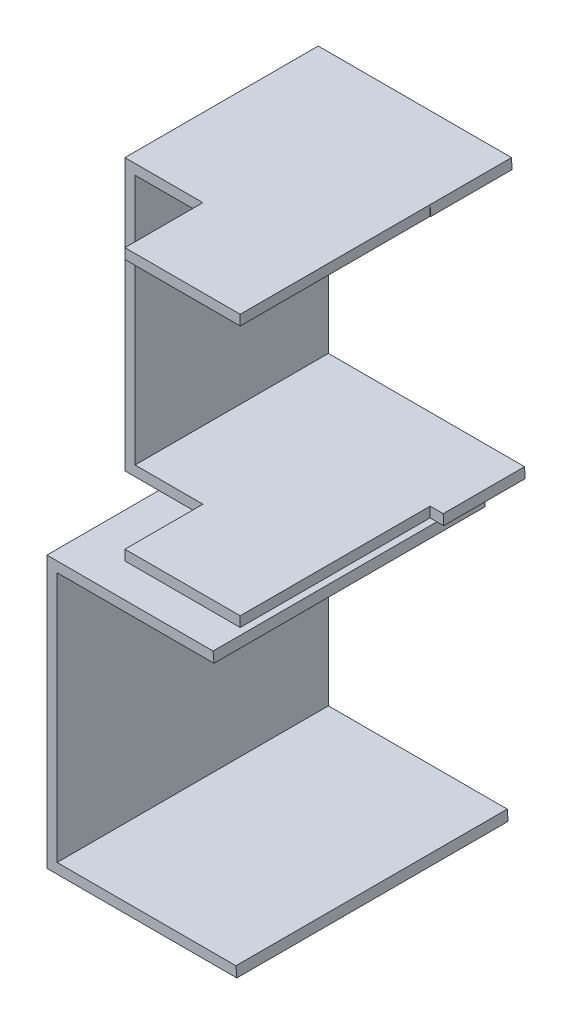
ISO-10303-21;
HEADER;
FILE_DESCRIPTION(('STEP AP214'),'2;1');
FILE_NAME('part.step','',(''),(''),'','','');
FILE_SCHEMA(('AUTOMOTIVE_DESIGN { 1 0 10303 214 1 1 1 1 }'));
ENDSEC;
DATA;
#1=APPLICATION_CONTEXT('core data for automotive mechanical design processes');
#2=APPLICATION_PROTOCOL_DEFINITION('international standard','automotive_design',2000,#1);
#3=PRODUCT_CONTEXT('',#1,'mechanical');
#4=PRODUCT('Part','Part','',(#3));
#5=PRODUCT_RELATED_PRODUCT_CATEGORY('part','',(#4));
#6=PRODUCT_DEFINITION_FORMATION('','',#4);
#7=PRODUCT_DEFINITION_CONTEXT('part definition',#1,'design');
#8=PRODUCT_DEFINITION('design','',#6,#7);
#9=PRODUCT_DEFINITION_SHAPE('','',#8);
#10=(LENGTH_UNIT() NAMED_UNIT(*) SI_UNIT(.MILLI.,.METRE.));
#11=(NAMED_UNIT(*) PLANE_ANGLE_UNIT() SI_UNIT($,.RADIAN.));
#12=(NAMED_UNIT(*) SI_UNIT($,.STERADIAN.) SOLID_ANGLE_UNIT());
#13=UNCERTAINTY_MEASURE_WITH_UNIT(LENGTH_MEASURE(1.E-05),#10,'distance_accuracy_value','');
#14=(GEOMETRIC_REPRESENTATION_CONTEXT(3) GLOBAL_UNCERTAINTY_ASSIGNED_CONTEXT((#13)) GLOBAL_UNIT_ASSIGNED_CONTEXT((#10,
#11,#12)) REPRESENTATION_CONTEXT('',''));
#15=CARTESIAN_POINT('',(0.,0.,0.));
#16=DIRECTION('',(0.,0.,1.));
#17=DIRECTION('',(1.,0.,0.));
#18=AXIS2_PLACEMENT_3D('',#15,#16,#17);
#19=CARTESIAN_POINT('',(0.,-10.,80.));
#20=DIRECTION('',(1.,0.,0.));
#21=DIRECTION('',(0.,1.,0.));
#22=AXIS2_PLACEMENT_3D('',#19,#20,#21);
#23=PLANE('',#22);
#24=DIRECTION('',(0.,-1.,0.));
#25=VECTOR('',#24,1.);
#26=CARTESIAN_POINT('',(0.,-10.,0.));
#27=LINE('',#26,#25);
#28=CARTESIAN_POINT('',(0.,-10.,0.));
#29=VERTEX_POINT('',#28);
#30=CARTESIAN_POINT('',(0.,-90.,0.));
#31=VERTEX_POINT('',#30);
#32=EDGE_CURVE('E144',#29,#31,#27,.T.);
#33=ORIENTED_EDGE('',*,*,#32,.T.);
#34=DIRECTION('',(0.,0.,-1.));
#35=VECTOR('',#34,1.);
#36=CARTESIAN_POINT('',(0.,-90.,80.));
#37=LINE('',#36,#35);
#38=CARTESIAN_POINT('',(0.,-90.,80.));
#39=VERTEX_POINT('',#38);
#40=EDGE_CURVE('E12',#39,#31,#37,.T.);
#41=ORIENTED_EDGE('',*,*,#40,.F.);
#42=DIRECTION('',(0.,-1.,0.));
#43=VECTOR('',#42,1.);
#44=CARTESIAN_POINT('',(0.,-10.,80.));
#45=LINE('',#44,#43);
#46=CARTESIAN_POINT('',(0.,-10.,80.));
#47=VERTEX_POINT('',#46);
#48=EDGE_CURVE('E164',#47,#39,#45,.T.);
#49=ORIENTED_EDGE('',*,*,#48,.F.);
#50=DIRECTION('',(0.,0.,-1.));
#51=VECTOR('',#50,1.);
#52=CARTESIAN_POINT('',(0.,-10.,80.));
#53=LINE('',#52,#51);
#54=EDGE_CURVE('E61',#47,#29,#53,.T.);
#55=ORIENTED_EDGE('',*,*,#54,.T.);
#56=EDGE_LOOP('',(#33,#41,#49,#55));
#57=FACE_BOUND('',#56,.T.);
#58=ADVANCED_FACE('F45',(#57),#23,.F.);
#59=CARTESIAN_POINT('',(0.,-90.,80.));
#60=DIRECTION('',(0.,1.,0.));
#61=DIRECTION('',(0.,0.,1.));
#62=AXIS2_PLACEMENT_3D('',#59,#60,#61);
#63=PLANE('',#62);
#64=DIRECTION('',(1.,0.,0.));
#65=VECTOR('',#64,1.);
#66=CARTESIAN_POINT('',(0.,-90.,0.));
#67=LINE('',#66,#65);
#68=CARTESIAN_POINT('',(56.,-90.,0.));
#69=VERTEX_POINT('',#68);
#70=EDGE_CURVE('E146',#31,#69,#67,.T.);
#71=ORIENTED_EDGE('',*,*,#70,.T.);
#72=DIRECTION('',(0.,0.,-1.));
#73=VECTOR('',#72,1.);
#74=CARTESIAN_POINT('',(56.,-90.,80.));
#75=LINE('',#74,#73);
#76=CARTESIAN_POINT('',(56.,-90.,80.));
#77=VERTEX_POINT('',#76);
#78=EDGE_CURVE('E53',#77,#69,#75,.T.);
#79=ORIENTED_EDGE('',*,*,#78,.F.);
#80=DIRECTION('',(1.,0.,0.));
#81=VECTOR('',#80,1.);
#82=CARTESIAN_POINT('',(0.,-90.,80.));
#83=LINE('',#82,#81);
#84=EDGE_CURVE('E100',#39,#77,#83,.T.);
#85=ORIENTED_EDGE('',*,*,#84,.F.);
#86=ORIENTED_EDGE('',*,*,#40,.T.);
#87=EDGE_LOOP('',(#71,#79,#85,#86));
#88=FACE_BOUND('',#87,.T.);
#89=ADVANCED_FACE('F177',(#88),#63,.F.);
#90=CARTESIAN_POINT('',(55.7375,-87.,80.));
#91=DIRECTION('',(0.996193717496113,0.0871669502809117,0.));
#92=DIRECTION('',(-0.0871669502809117,0.996193717496113,0.));
#93=AXIS2_PLACEMENT_3D('',#90,#91,#92);
#94=PLANE('',#93);
#95=DIRECTION('',(0.0871669502809117,-0.996193717496113,0.));
#96=VECTOR('',#95,1.);
#97=CARTESIAN_POINT('',(55.7375,-87.,0.));
#98=LINE('',#97,#96);
#99=CARTESIAN_POINT('',(55.7375,-87.,0.));
#100=VERTEX_POINT('',#99);
#101=EDGE_CURVE('E149',#100,#69,#98,.T.);
#102=ORIENTED_EDGE('',*,*,#101,.F.);
#103=DIRECTION('',(0.,0.,-1.));
#104=VECTOR('',#103,1.);
#105=CARTESIAN_POINT('',(55.7375,-87.,80.));
#106=LINE('',#105,#104);
#107=CARTESIAN_POINT('',(55.7375,-87.,80.));
#108=VERTEX_POINT('',#107);
#109=EDGE_CURVE('E170',#108,#100,#106,.T.);
#110=ORIENTED_EDGE('',*,*,#109,.F.);
#111=DIRECTION('',(0.0871669502809117,-0.996193717496113,0.));
#112=VECTOR('',#111,1.);
#113=CARTESIAN_POINT('',(55.7375,-87.,80.));
#114=LINE('',#113,#112);
#115=EDGE_CURVE('E176',#108,#77,#114,.T.);
#116=ORIENTED_EDGE('',*,*,#115,.T.);
#117=ORIENTED_EDGE('',*,*,#78,.T.);
#118=EDGE_LOOP('',(#102,#110,#116,#117));
#119=FACE_BOUND('',#118,.T.);
#120=ADVANCED_FACE('F174',(#119),#94,.T.);
#121=CARTESIAN_POINT('',(3.00000000000001,-87.,80.));
#122=DIRECTION('',(0.,1.,0.));
#123=DIRECTION('',(0.,0.,1.));
#124=AXIS2_PLACEMENT_3D('',#121,#122,#123);
#125=PLANE('',#124);
#126=DIRECTION('',(1.,0.,0.));
#127=VECTOR('',#126,1.);
#128=CARTESIAN_POINT('',(3.00000000000001,-87.,0.));
#129=LINE('',#128,#127);
#130=CARTESIAN_POINT('',(3.00000000000001,-87.,0.));
#131=VERTEX_POINT('',#130);
#132=EDGE_CURVE('E152',#131,#100,#129,.T.);
#133=ORIENTED_EDGE('',*,*,#132,.F.);
#134=DIRECTION('',(0.,0.,-1.));
#135=VECTOR('',#134,1.);
#136=CARTESIAN_POINT('',(3.00000000000001,-87.,80.));
#137=LINE('',#136,#135);
#138=CARTESIAN_POINT('',(3.00000000000001,-87.,80.));
#139=VERTEX_POINT('',#138);
#140=EDGE_CURVE('E168',#139,#131,#137,.T.);
#141=ORIENTED_EDGE('',*,*,#140,.F.);
#142=DIRECTION('',(1.,0.,0.));
#143=VECTOR('',#142,1.);
#144=CARTESIAN_POINT('',(3.00000000000001,-87.,80.));
#145=LINE('',#144,#143);
#146=EDGE_CURVE('E139',#139,#108,#145,.T.);
#147=ORIENTED_EDGE('',*,*,#146,.T.);
#148=ORIENTED_EDGE('',*,*,#109,.T.);
#149=EDGE_LOOP('',(#133,#141,#147,#148));
#150=FACE_BOUND('',#149,.T.);
#151=ADVANCED_FACE('F184',(#150),#125,.T.);
#152=CARTESIAN_POINT('',(3.,-13.,80.));
#153=DIRECTION('',(1.,0.,0.));
#154=DIRECTION('',(0.,1.,0.));
#155=AXIS2_PLACEMENT_3D('',#152,#153,#154);
#156=PLANE('',#155);
#157=DIRECTION('',(0.,-1.,0.));
#158=VECTOR('',#157,1.);
#159=CARTESIAN_POINT('',(3.,-13.,0.));
#160=LINE('',#159,#158);
#161=CARTESIAN_POINT('',(3.,-13.,0.));
#162=VERTEX_POINT('',#161);
#163=EDGE_CURVE('E155',#162,#131,#160,.T.);
#164=ORIENTED_EDGE('',*,*,#163,.F.);
#165=DIRECTION('',(0.,0.,-1.));
#166=VECTOR('',#165,1.);
#167=CARTESIAN_POINT('',(3.,-13.,80.));
#168=LINE('',#167,#166);
#169=CARTESIAN_POINT('',(3.,-13.,80.));
#170=VERTEX_POINT('',#169);
#171=EDGE_CURVE('E125',#170,#162,#168,.T.);
#172=ORIENTED_EDGE('',*,*,#171,.F.);
#173=DIRECTION('',(0.,-1.,0.));
#174=VECTOR('',#173,1.);
#175=CARTESIAN_POINT('',(3.,-13.,80.));
#176=LINE('',#175,#174);
#177=EDGE_CURVE('E137',#170,#139,#176,.T.);
#178=ORIENTED_EDGE('',*,*,#177,.T.);
#179=ORIENTED_EDGE('',*,*,#140,.T.);
#180=EDGE_LOOP('',(#164,#172,#178,#179));
#181=FACE_BOUND('',#180,.T.);
#182=ADVANCED_FACE('F210',(#181),#156,.T.);
#183=CARTESIAN_POINT('',(49.2625,-13.,80.));
#184=DIRECTION('',(0.,-1.,0.));
#185=DIRECTION('',(1.,0.,0.));
#186=AXIS2_PLACEMENT_3D('',#183,#184,#185);
#187=PLANE('',#186);
#188=DIRECTION('',(-1.,0.,0.));
#189=VECTOR('',#188,1.);
#190=CARTESIAN_POINT('',(49.2625,-13.,0.));
#191=LINE('',#190,#189);
#192=CARTESIAN_POINT('',(49.2625,-13.,0.));
#193=VERTEX_POINT('',#192);
#194=EDGE_CURVE('E122',#193,#162,#191,.T.);
#195=ORIENTED_EDGE('',*,*,#194,.F.);
#196=DIRECTION('',(0.,0.,-1.));
#197=VECTOR('',#196,1.);
#198=CARTESIAN_POINT('',(49.2625,-13.,80.));
#199=LINE('',#198,#197);
#200=CARTESIAN_POINT('',(49.2625,-13.,80.));
#201=VERTEX_POINT('',#200);
#202=EDGE_CURVE('E116',#201,#193,#199,.T.);
#203=ORIENTED_EDGE('',*,*,#202,.F.);
#204=DIRECTION('',(-1.,0.,0.));
#205=VECTOR('',#204,1.);
#206=CARTESIAN_POINT('',(49.2625,-13.,80.));
#207=LINE('',#206,#205);
#208=EDGE_CURVE('E120',#201,#170,#207,.T.);
#209=ORIENTED_EDGE('',*,*,#208,.T.);
#210=ORIENTED_EDGE('',*,*,#171,.T.);
#211=EDGE_LOOP('',(#195,#203,#209,#210));
#212=FACE_BOUND('',#211,.T.);
#213=ADVANCED_FACE('F118',(#212),#187,.T.);
#214=CARTESIAN_POINT('',(49.2625,-13.,80.));
#215=DIRECTION('',(-0.996193717496113,-0.0871669502809117,0.));
#216=DIRECTION('',(0.0871669502809117,-0.996193717496113,0.));
#217=AXIS2_PLACEMENT_3D('',#214,#215,#216);
#218=PLANE('',#217);
#219=DIRECTION('',(-0.0871669502809117,0.996193717496113,0.));
#220=VECTOR('',#219,1.);
#221=CARTESIAN_POINT('',(49.2625,-13.,0.));
#222=LINE('',#221,#220);
#223=CARTESIAN_POINT('',(49.,-10.,0.));
#224=VERTEX_POINT('',#223);
#225=EDGE_CURVE('E159',#193,#224,#222,.T.);
#226=ORIENTED_EDGE('',*,*,#225,.T.);
#227=DIRECTION('',(0.,0.,-1.));
#228=VECTOR('',#227,1.);
#229=CARTESIAN_POINT('',(49.,-10.,80.));
#230=LINE('',#229,#228);
#231=CARTESIAN_POINT('',(49.,-10.,80.));
#232=VERTEX_POINT('',#231);
#233=EDGE_CURVE('E88',#232,#224,#230,.T.);
#234=ORIENTED_EDGE('',*,*,#233,.F.);
#235=DIRECTION('',(-0.0871669502809117,0.996193717496113,0.));
#236=VECTOR('',#235,1.);
#237=CARTESIAN_POINT('',(49.2625,-13.,80.));
#238=LINE('',#237,#236);
#239=EDGE_CURVE('E127',#201,#232,#238,.T.);
#240=ORIENTED_EDGE('',*,*,#239,.F.);
#241=ORIENTED_EDGE('',*,*,#202,.T.);
#242=EDGE_LOOP('',(#226,#234,#240,#241));
#243=FACE_BOUND('',#242,.T.);
#244=ADVANCED_FACE('F128',(#243),#218,.F.);
#245=CARTESIAN_POINT('',(0.,-10.,80.));
#246=DIRECTION('',(0.,1.,0.));
#247=DIRECTION('',(0.,0.,1.));
#248=AXIS2_PLACEMENT_3D('',#245,#246,#247);
#249=PLANE('',#248);
#250=DIRECTION('',(1.,0.,0.));
#251=VECTOR('',#250,1.);
#252=CARTESIAN_POINT('',(0.,-10.,0.));
#253=LINE('',#252,#251);
#254=EDGE_CURVE('E161',#29,#224,#253,.T.);
#255=ORIENTED_EDGE('',*,*,#254,.F.);
#256=ORIENTED_EDGE('',*,*,#54,.F.);
#257=DIRECTION('',(1.,0.,0.));
#258=VECTOR('',#257,1.);
#259=CARTESIAN_POINT('',(0.,-10.,80.));
#260=LINE('',#259,#258);
#261=EDGE_CURVE('E131',#47,#232,#260,.T.);
#262=ORIENTED_EDGE('',*,*,#261,.T.);
#263=ORIENTED_EDGE('',*,*,#233,.T.);
#264=EDGE_LOOP('',(#255,#256,#262,#263));
#265=FACE_BOUND('',#264,.T.);
#266=ADVANCED_FACE('F189',(#265),#249,.T.);
#267=CARTESIAN_POINT('',(0.,0.,80.));
#268=DIRECTION('',(0.,0.,1.));
#269=DIRECTION('',(1.,0.,0.));
#270=AXIS2_PLACEMENT_3D('',#267,#268,#269);
#271=PLANE('',#270);
#272=ORIENTED_EDGE('',*,*,#48,.T.);
#273=ORIENTED_EDGE('',*,*,#84,.T.);
#274=ORIENTED_EDGE('',*,*,#115,.F.);
#275=ORIENTED_EDGE('',*,*,#146,.F.);
#276=ORIENTED_EDGE('',*,*,#177,.F.);
#277=ORIENTED_EDGE('',*,*,#208,.F.);
#278=ORIENTED_EDGE('',*,*,#239,.T.);
#279=ORIENTED_EDGE('',*,*,#261,.F.);
#280=EDGE_LOOP('',(#272,#273,#274,#275,#276,#277,#278,#279));
#281=FACE_BOUND('',#280,.T.);
#282=ADVANCED_FACE('F134',(#281),#271,.T.);
#283=CARTESIAN_POINT('',(0.,0.,0.));
#284=DIRECTION('',(0.,0.,1.));
#285=DIRECTION('',(1.,0.,0.));
#286=AXIS2_PLACEMENT_3D('',#283,#284,#285);
#287=PLANE('',#286);
#288=ORIENTED_EDGE('',*,*,#32,.F.);
#289=ORIENTED_EDGE('',*,*,#254,.T.);
#290=ORIENTED_EDGE('',*,*,#225,.F.);
#291=ORIENTED_EDGE('',*,*,#194,.T.);
#292=ORIENTED_EDGE('',*,*,#163,.T.);
#293=ORIENTED_EDGE('',*,*,#132,.T.);
#294=ORIENTED_EDGE('',*,*,#101,.T.);
#295=ORIENTED_EDGE('',*,*,#70,.F.);
#296=EDGE_LOOP('',(#288,#289,#290,#291,#292,#293,#294,#295));
#297=FACE_BOUND('',#296,.T.);
#298=ADVANCED_FACE('F180',(#297),#287,.F.);
#299=CLOSED_SHELL('',(#58,#89,#120,#151,#182,#213,#244,#266,#282,#298));
#300=MANIFOLD_SOLID_BREP('B2',#299);
#301=CARTESIAN_POINT('',(0.,0.,80.));
#302=DIRECTION('',(0.,0.,1.));
#303=DIRECTION('',(1.,0.,0.));
#304=AXIS2_PLACEMENT_3D('',#301,#302,#303);
#305=PLANE('',#304);
#306=DIRECTION('',(0.,1.,0.));
#307=VECTOR('',#306,1.);
#308=CARTESIAN_POINT('',(57.,0.,80.));
#309=LINE('',#308,#307);
#310=CARTESIAN_POINT('',(57.,0.,80.));
#311=VERTEX_POINT('',#310);
#312=CARTESIAN_POINT('',(57.,3.,80.));
#313=VERTEX_POINT('',#312);
#314=EDGE_CURVE('E384',#311,#313,#309,.T.);
#315=ORIENTED_EDGE('',*,*,#314,.T.);
#316=DIRECTION('',(1.,0.,0.));
#317=VECTOR('',#316,1.);
#318=CARTESIAN_POINT('',(3.00000000000001,3.,80.));
#319=LINE('',#318,#317);
#320=CARTESIAN_POINT('',(23.,3.,80.));
#321=VERTEX_POINT('',#320);
#322=EDGE_CURVE('E409',#321,#313,#319,.T.);
#323=ORIENTED_EDGE('',*,*,#322,.F.);
#324=DIRECTION('',(0.,1.,0.));
#325=VECTOR('',#324,1.);
#326=CARTESIAN_POINT('',(23.,0.,80.));
#327=LINE('',#326,#325);
#328=CARTESIAN_POINT('',(23.,0.,80.));
#329=VERTEX_POINT('',#328);
#330=EDGE_CURVE('E407',#329,#321,#327,.T.);
#331=ORIENTED_EDGE('',*,*,#330,.F.);
#332=DIRECTION('',(1.,0.,0.));
#333=VECTOR('',#332,1.);
#334=CARTESIAN_POINT('',(0.,0.,80.));
#335=LINE('',#334,#333);
#336=EDGE_CURVE('E403',#329,#311,#335,.T.);
#337=ORIENTED_EDGE('',*,*,#336,.T.);
#338=EDGE_LOOP('',(#315,#323,#331,#337));
#339=FACE_BOUND('',#338,.T.);
#340=ADVANCED_FACE('F273',(#339),#305,.T.);
#341=CARTESIAN_POINT('',(3.,77.,80.));
#342=DIRECTION('',(1.,0.,0.));
#343=DIRECTION('',(0.,1.,0.));
#344=AXIS2_PLACEMENT_3D('',#341,#342,#343);
#345=PLANE('',#344);
#346=DIRECTION('',(0.,1.,0.));
#347=VECTOR('',#346,1.);
#348=CARTESIAN_POINT('',(3.,77.,57.));
#349=LINE('',#348,#347);
#350=CARTESIAN_POINT('',(3.00000000000001,3.,57.));
#351=VERTEX_POINT('',#350);
#352=CARTESIAN_POINT('',(3.,77.,57.));
#353=VERTEX_POINT('',#352);
#354=EDGE_CURVE('E510',#351,#353,#349,.T.);
#355=ORIENTED_EDGE('',*,*,#354,.F.);
#356=DIRECTION('',(0.,0.,-1.));
#357=VECTOR('',#356,1.);
#358=CARTESIAN_POINT('',(3.00000000000001,3.,80.));
#359=LINE('',#358,#357);
#360=CARTESIAN_POINT('',(3.00000000000001,3.,0.));
#361=VERTEX_POINT('',#360);
#362=EDGE_CURVE('E418',#351,#361,#359,.T.);
#363=ORIENTED_EDGE('',*,*,#362,.T.);
#364=DIRECTION('',(0.,-1.,0.));
#365=VECTOR('',#364,1.);
#366=CARTESIAN_POINT('',(3.,77.,0.));
#367=LINE('',#366,#365);
#368=CARTESIAN_POINT('',(3.,77.,0.));
#369=VERTEX_POINT('',#368);
#370=EDGE_CURVE('E419',#369,#361,#367,.T.);
#371=ORIENTED_EDGE('',*,*,#370,.F.);
#372=DIRECTION('',(0.,0.,-1.));
#373=VECTOR('',#372,1.);
#374=CARTESIAN_POINT('',(3.,77.,80.));
#375=LINE('',#374,#373);
#376=EDGE_CURVE('E443',#353,#369,#375,.T.);
#377=ORIENTED_EDGE('',*,*,#376,.F.);
#378=EDGE_LOOP('',(#355,#363,#371,#377));
#379=FACE_BOUND('',#378,.T.);
#380=ADVANCED_FACE('F275',(#379),#345,.T.);
#381=CARTESIAN_POINT('',(57.15,77.,80.));
#382=DIRECTION('',(0.,-1.,0.));
#383=DIRECTION('',(1.,0.,0.));
#384=AXIS2_PLACEMENT_3D('',#381,#382,#383);
#385=PLANE('',#384);
#386=DIRECTION('',(0.,0.,-1.));
#387=VECTOR('',#386,1.);
#388=CARTESIAN_POINT('',(57.,77.,80.));
#389=LINE('',#388,#387);
#390=CARTESIAN_POINT('',(57.,77.,80.));
#391=VERTEX_POINT('',#390);
#392=CARTESIAN_POINT('',(57.,77.,24.));
#393=VERTEX_POINT('',#392);
#394=EDGE_CURVE('E467',#391,#393,#389,.T.);
#395=ORIENTED_EDGE('',*,*,#394,.F.);
#396=DIRECTION('',(-1.,0.,0.));
#397=VECTOR('',#396,1.);
#398=CARTESIAN_POINT('',(57.15,77.,80.));
#399=LINE('',#398,#397);
#400=CARTESIAN_POINT('',(23.,77.,80.));
#401=VERTEX_POINT('',#400);
#402=EDGE_CURVE('E295',#391,#401,#399,.T.);
#403=ORIENTED_EDGE('',*,*,#402,.T.);
#404=DIRECTION('',(0.,0.,1.));
#405=VECTOR('',#404,1.);
#406=CARTESIAN_POINT('',(23.,77.,80.));
#407=LINE('',#406,#405);
#408=CARTESIAN_POINT('',(23.,77.,57.));
#409=VERTEX_POINT('',#408);
#410=EDGE_CURVE('E485',#409,#401,#407,.T.);
#411=ORIENTED_EDGE('',*,*,#410,.F.);
#412=DIRECTION('',(1.,0.,0.));
#413=VECTOR('',#412,1.);
#414=CARTESIAN_POINT('',(57.15,77.,57.));
#415=LINE('',#414,#413);
#416=EDGE_CURVE('E423',#353,#409,#415,.T.);
#417=ORIENTED_EDGE('',*,*,#416,.F.);
#418=ORIENTED_EDGE('',*,*,#376,.T.);
#419=DIRECTION('',(-1.,0.,0.));
#420=VECTOR('',#419,1.);
#421=CARTESIAN_POINT('',(57.15,77.,0.));
#422=LINE('',#421,#420);
#423=CARTESIAN_POINT('',(57.15,77.,0.));
#424=VERTEX_POINT('',#423);
#425=EDGE_CURVE('E413',#424,#369,#422,.T.);
#426=ORIENTED_EDGE('',*,*,#425,.F.);
#427=DIRECTION('',(0.,0.,-1.));
#428=VECTOR('',#427,1.);
#429=CARTESIAN_POINT('',(57.15,77.,80.));
#430=LINE('',#429,#428);
#431=CARTESIAN_POINT('',(57.15,77.,24.));
#432=VERTEX_POINT('',#431);
#433=EDGE_CURVE('E446',#432,#424,#430,.T.);
#434=ORIENTED_EDGE('',*,*,#433,.F.);
#435=DIRECTION('',(1.,0.,0.));
#436=VECTOR('',#435,1.);
#437=CARTESIAN_POINT('',(57.15,77.,24.));
#438=LINE('',#437,#436);
#439=EDGE_CURVE('E474',#393,#432,#438,.T.);
#440=ORIENTED_EDGE('',*,*,#439,.F.);
#441=EDGE_LOOP('',(#395,#403,#411,#417,#418,#426,#434,#440));
#442=FACE_BOUND('',#441,.T.);
#443=ADVANCED_FACE('F472',(#442),#385,.T.);
#444=CARTESIAN_POINT('',(57.15,77.,80.));
#445=DIRECTION('',(-0.998752338877845,-0.0499376169438913,0.));
#446=DIRECTION('',(0.0499376169438913,-0.998752338877845,0.));
#447=AXIS2_PLACEMENT_3D('',#444,#445,#446);
#448=PLANE('',#447);
#449=DIRECTION('',(0.,0.,-1.));
#450=VECTOR('',#449,1.);
#451=CARTESIAN_POINT('',(57.,80.,80.));
#452=LINE('',#451,#450);
#453=CARTESIAN_POINT('',(57.,80.,24.));
#454=VERTEX_POINT('',#453);
#455=CARTESIAN_POINT('',(57.,80.,0.));
#456=VERTEX_POINT('',#455);
#457=EDGE_CURVE('E451',#454,#456,#452,.T.);
#458=ORIENTED_EDGE('',*,*,#457,.F.);
#459=DIRECTION('',(0.0499376169438913,-0.998752338877845,0.));
#460=VECTOR('',#459,1.);
#461=CARTESIAN_POINT('',(57.15,77.,24.));
#462=LINE('',#461,#460);
#463=EDGE_CURVE('E493',#454,#432,#462,.T.);
#464=ORIENTED_EDGE('',*,*,#463,.T.);
#465=ORIENTED_EDGE('',*,*,#433,.T.);
#466=DIRECTION('',(-0.0499376169438913,0.998752338877845,0.));
#467=VECTOR('',#466,1.);
#468=CARTESIAN_POINT('',(57.15,77.,0.));
#469=LINE('',#468,#467);
#470=EDGE_CURVE('E438',#424,#456,#469,.T.);
#471=ORIENTED_EDGE('',*,*,#470,.T.);
#472=EDGE_LOOP('',(#458,#464,#465,#471));
#473=FACE_BOUND('',#472,.T.);
#474=ADVANCED_FACE('F528',(#473),#448,.F.);
#475=CARTESIAN_POINT('',(57.,80.,80.));
#476=DIRECTION('',(0.,-1.,0.));
#477=DIRECTION('',(1.,0.,0.));
#478=AXIS2_PLACEMENT_3D('',#475,#476,#477);
#479=PLANE('',#478);
#480=DIRECTION('',(0.,0.,-1.));
#481=VECTOR('',#480,1.);
#482=CARTESIAN_POINT('',(0.,80.,80.));
#483=LINE('',#482,#481);
#484=CARTESIAN_POINT('',(0.,80.,57.));
#485=VERTEX_POINT('',#484);
#486=CARTESIAN_POINT('',(0.,80.,0.));
#487=VERTEX_POINT('',#486);
#488=EDGE_CURVE('E452',#485,#487,#483,.T.);
#489=ORIENTED_EDGE('',*,*,#488,.F.);
#490=DIRECTION('',(-1.,0.,0.));
#491=VECTOR('',#490,1.);
#492=CARTESIAN_POINT('',(23.,80.,57.));
#493=LINE('',#492,#491);
#494=CARTESIAN_POINT('',(23.,80.,57.));
#495=VERTEX_POINT('',#494);
#496=EDGE_CURVE('E489',#495,#485,#493,.T.);
#497=ORIENTED_EDGE('',*,*,#496,.F.);
#498=DIRECTION('',(0.,0.,-1.));
#499=VECTOR('',#498,1.);
#500=CARTESIAN_POINT('',(23.,80.,80.));
#501=LINE('',#500,#499);
#502=CARTESIAN_POINT('',(23.,80.,80.));
#503=VERTEX_POINT('',#502);
#504=EDGE_CURVE('E483',#503,#495,#501,.T.);
#505=ORIENTED_EDGE('',*,*,#504,.F.);
#506=DIRECTION('',(-1.,0.,0.));
#507=VECTOR('',#506,1.);
#508=CARTESIAN_POINT('',(57.,80.,80.));
#509=LINE('',#508,#507);
#510=CARTESIAN_POINT('',(57.,80.,80.));
#511=VERTEX_POINT('',#510);
#512=EDGE_CURVE('E408',#511,#503,#509,.T.);
#513=ORIENTED_EDGE('',*,*,#512,.F.);
#514=EDGE_CURVE('E448',#511,#454,#452,.T.);
#515=ORIENTED_EDGE('',*,*,#514,.T.);
#516=ORIENTED_EDGE('',*,*,#457,.T.);
#517=DIRECTION('',(-1.,0.,0.));
#518=VECTOR('',#517,1.);
#519=CARTESIAN_POINT('',(57.,80.,0.));
#520=LINE('',#519,#518);
#521=EDGE_CURVE('E435',#456,#487,#520,.T.);
#522=ORIENTED_EDGE('',*,*,#521,.T.);
#523=EDGE_LOOP('',(#489,#497,#505,#513,#515,#516,#522));
#524=FACE_BOUND('',#523,.T.);
#525=ADVANCED_FACE('F488',(#524),#479,.F.);
#526=CARTESIAN_POINT('',(0.,80.,80.));
#527=DIRECTION('',(1.,0.,0.));
#528=DIRECTION('',(0.,0.,-1.));
#529=AXIS2_PLACEMENT_3D('',#526,#527,#528);
#530=PLANE('',#529);
#531=DIRECTION('',(0.,0.,-1.));
#532=VECTOR('',#531,1.);
#533=CARTESIAN_POINT('',(0.,0.,80.));
#534=LINE('',#533,#532);
#535=CARTESIAN_POINT('',(0.,0.,57.));
#536=VERTEX_POINT('',#535);
#537=CARTESIAN_POINT('',(0.,0.,0.));
#538=VERTEX_POINT('',#537);
#539=EDGE_CURVE('E454',#536,#538,#534,.T.);
#540=ORIENTED_EDGE('',*,*,#539,.F.);
#541=DIRECTION('',(0.,1.,0.));
#542=VECTOR('',#541,1.);
#543=CARTESIAN_POINT('',(0.,0.,57.));
#544=LINE('',#543,#542);
#545=EDGE_CURVE('E499',#536,#485,#544,.T.);
#546=ORIENTED_EDGE('',*,*,#545,.T.);
#547=ORIENTED_EDGE('',*,*,#488,.T.);
#548=DIRECTION('',(0.,-1.,0.));
#549=VECTOR('',#548,1.);
#550=CARTESIAN_POINT('',(0.,80.,0.));
#551=LINE('',#550,#549);
#552=EDGE_CURVE('E432',#487,#538,#551,.T.);
#553=ORIENTED_EDGE('',*,*,#552,.T.);
#554=EDGE_LOOP('',(#540,#546,#547,#553));
#555=FACE_BOUND('',#554,.T.);
#556=ADVANCED_FACE('F536',(#555),#530,.F.);
#557=CARTESIAN_POINT('',(0.,0.,80.));
#558=DIRECTION('',(0.,1.,0.));
#559=DIRECTION('',(0.,0.,1.));
#560=AXIS2_PLACEMENT_3D('',#557,#558,#559);
#561=PLANE('',#560);
#562=DIRECTION('',(-1.,0.,0.));
#563=VECTOR('',#562,1.);
#564=CARTESIAN_POINT('',(61.,0.,24.));
#565=LINE('',#564,#563);
#566=CARTESIAN_POINT('',(61.,0.,24.));
#567=VERTEX_POINT('',#566);
#568=CARTESIAN_POINT('',(57.,0.,24.));
#569=VERTEX_POINT('',#568);
#570=EDGE_CURVE('E397',#567,#569,#565,.T.);
#571=ORIENTED_EDGE('',*,*,#570,.T.);
#572=DIRECTION('',(0.,0.,1.));
#573=VECTOR('',#572,1.);
#574=CARTESIAN_POINT('',(57.,0.,24.));
#575=LINE('',#574,#573);
#576=EDGE_CURVE('E388',#569,#311,#575,.T.);
#577=ORIENTED_EDGE('',*,*,#576,.T.);
#578=ORIENTED_EDGE('',*,*,#336,.F.);
#579=DIRECTION('',(0.,0.,-1.));
#580=VECTOR('',#579,1.);
#581=CARTESIAN_POINT('',(23.,0.,80.));
#582=LINE('',#581,#580);
#583=CARTESIAN_POINT('',(23.,0.,57.));
#584=VERTEX_POINT('',#583);
#585=EDGE_CURVE('E491',#329,#584,#582,.T.);
#586=ORIENTED_EDGE('',*,*,#585,.T.);
#587=DIRECTION('',(-1.,0.,0.));
#588=VECTOR('',#587,1.);
#589=CARTESIAN_POINT('',(23.,0.,57.));
#590=LINE('',#589,#588);
#591=EDGE_CURVE('E496',#584,#536,#590,.T.);
#592=ORIENTED_EDGE('',*,*,#591,.T.);
#593=ORIENTED_EDGE('',*,*,#539,.T.);
#594=DIRECTION('',(1.,0.,0.));
#595=VECTOR('',#594,1.);
#596=CARTESIAN_POINT('',(0.,0.,0.));
#597=LINE('',#596,#595);
#598=CARTESIAN_POINT('',(61.,0.,0.));
#599=VERTEX_POINT('',#598);
#600=EDGE_CURVE('E429',#538,#599,#597,.T.);
#601=ORIENTED_EDGE('',*,*,#600,.T.);
#602=DIRECTION('',(0.,0.,-1.));
#603=VECTOR('',#602,1.);
#604=CARTESIAN_POINT('',(61.,0.,80.));
#605=LINE('',#604,#603);
#606=EDGE_CURVE('E456',#567,#599,#605,.T.);
#607=ORIENTED_EDGE('',*,*,#606,.F.);
#608=EDGE_LOOP('',(#571,#577,#578,#586,#592,#593,#601,#607));
#609=FACE_BOUND('',#608,.T.);
#610=ADVANCED_FACE('F401',(#609),#561,.F.);
#611=CARTESIAN_POINT('',(61.,0.,80.));
#612=DIRECTION('',(-0.998752338877845,-0.0499376169438937,0.));
#613=DIRECTION('',(0.0499376169438937,-0.998752338877845,0.));
#614=AXIS2_PLACEMENT_3D('',#611,#612,#613);
#615=PLANE('',#614);
#616=DIRECTION('',(0.,0.,-1.));
#617=VECTOR('',#616,1.);
#618=CARTESIAN_POINT('',(60.85,3.,80.));
#619=LINE('',#618,#617);
#620=CARTESIAN_POINT('',(60.85,3.,24.));
#621=VERTEX_POINT('',#620);
#622=CARTESIAN_POINT('',(60.85,3.,0.));
#623=VERTEX_POINT('',#622);
#624=EDGE_CURVE('E458',#621,#623,#619,.T.);
#625=ORIENTED_EDGE('',*,*,#624,.F.);
#626=DIRECTION('',(0.0499376169438937,-0.998752338877845,0.));
#627=VECTOR('',#626,1.);
#628=CARTESIAN_POINT('',(61.,0.,24.));
#629=LINE('',#628,#627);
#630=EDGE_CURVE('E287',#621,#567,#629,.T.);
#631=ORIENTED_EDGE('',*,*,#630,.T.);
#632=ORIENTED_EDGE('',*,*,#606,.T.);
#633=DIRECTION('',(-0.0499376169438937,0.998752338877845,0.));
#634=VECTOR('',#633,1.);
#635=CARTESIAN_POINT('',(61.,0.,0.));
#636=LINE('',#635,#634);
#637=EDGE_CURVE('E426',#599,#623,#636,.T.);
#638=ORIENTED_EDGE('',*,*,#637,.T.);
#639=EDGE_LOOP('',(#625,#631,#632,#638));
#640=FACE_BOUND('',#639,.T.);
#641=ADVANCED_FACE('F542',(#640),#615,.F.);
#642=CARTESIAN_POINT('',(3.00000000000001,3.,80.));
#643=DIRECTION('',(0.,1.,0.));
#644=DIRECTION('',(0.,0.,1.));
#645=AXIS2_PLACEMENT_3D('',#642,#643,#644);
#646=PLANE('',#645);
#647=DIRECTION('',(0.,0.,1.));
#648=VECTOR('',#647,1.);
#649=CARTESIAN_POINT('',(57.,3.,80.));
#650=LINE('',#649,#648);
#651=CARTESIAN_POINT('',(57.,3.,24.));
#652=VERTEX_POINT('',#651);
#653=EDGE_CURVE('E391',#652,#313,#650,.T.);
#654=ORIENTED_EDGE('',*,*,#653,.F.);
#655=DIRECTION('',(-1.,0.,0.));
#656=VECTOR('',#655,1.);
#657=CARTESIAN_POINT('',(3.00000000000001,3.,24.));
#658=LINE('',#657,#656);
#659=EDGE_CURVE('E43',#621,#652,#658,.T.);
#660=ORIENTED_EDGE('',*,*,#659,.F.);
#661=ORIENTED_EDGE('',*,*,#624,.T.);
#662=DIRECTION('',(1.,0.,0.));
#663=VECTOR('',#662,1.);
#664=CARTESIAN_POINT('',(3.00000000000001,3.,0.));
#665=LINE('',#664,#663);
#666=EDGE_CURVE('E422',#361,#623,#665,.T.);
#667=ORIENTED_EDGE('',*,*,#666,.F.);
#668=ORIENTED_EDGE('',*,*,#362,.F.);
#669=DIRECTION('',(-1.,0.,0.));
#670=VECTOR('',#669,1.);
#671=CARTESIAN_POINT('',(3.00000000000001,3.,57.));
#672=LINE('',#671,#670);
#673=CARTESIAN_POINT('',(23.,3.,57.));
#674=VERTEX_POINT('',#673);
#675=EDGE_CURVE('E462',#674,#351,#672,.T.);
#676=ORIENTED_EDGE('',*,*,#675,.F.);
#677=DIRECTION('',(0.,0.,-1.));
#678=VECTOR('',#677,1.);
#679=CARTESIAN_POINT('',(23.,3.,80.));
#680=LINE('',#679,#678);
#681=EDGE_CURVE('E502',#321,#674,#680,.T.);
#682=ORIENTED_EDGE('',*,*,#681,.F.);
#683=ORIENTED_EDGE('',*,*,#322,.T.);
#684=EDGE_LOOP('',(#654,#660,#661,#667,#668,#676,#682,#683));
#685=FACE_BOUND('',#684,.T.);
#686=ADVANCED_FACE('F544',(#685),#646,.T.);
#687=DIRECTION('',(0.,-1.,0.));
#688=VECTOR('',#687,1.);
#689=CARTESIAN_POINT('',(57.,0.,80.));
#690=LINE('',#689,#688);
#691=EDGE_CURVE('E281',#511,#391,#690,.T.);
#692=ORIENTED_EDGE('',*,*,#691,.F.);
#693=ORIENTED_EDGE('',*,*,#512,.T.);
#694=DIRECTION('',(0.,1.,0.));
#695=VECTOR('',#694,1.);
#696=CARTESIAN_POINT('',(23.,0.,80.));
#697=LINE('',#696,#695);
#698=EDGE_CURVE('E445',#401,#503,#697,.T.);
#699=ORIENTED_EDGE('',*,*,#698,.F.);
#700=ORIENTED_EDGE('',*,*,#402,.F.);
#701=EDGE_LOOP('',(#692,#693,#699,#700));
#702=FACE_BOUND('',#701,.T.);
#703=ADVANCED_FACE('F477',(#702),#305,.T.);
#704=CARTESIAN_POINT('',(0.,0.,0.));
#705=DIRECTION('',(0.,0.,1.));
#706=DIRECTION('',(1.,0.,0.));
#707=AXIS2_PLACEMENT_3D('',#704,#705,#706);
#708=PLANE('',#707);
#709=ORIENTED_EDGE('',*,*,#370,.T.);
#710=ORIENTED_EDGE('',*,*,#666,.T.);
#711=ORIENTED_EDGE('',*,*,#637,.F.);
#712=ORIENTED_EDGE('',*,*,#600,.F.);
#713=ORIENTED_EDGE('',*,*,#552,.F.);
#714=ORIENTED_EDGE('',*,*,#521,.F.);
#715=ORIENTED_EDGE('',*,*,#470,.F.);
#716=ORIENTED_EDGE('',*,*,#425,.T.);
#717=EDGE_LOOP('',(#709,#710,#711,#712,#713,#714,#715,#716));
#718=FACE_BOUND('',#717,.T.);
#719=ADVANCED_FACE('F523',(#718),#708,.F.);
#720=CARTESIAN_POINT('',(23.,0.,80.));
#721=DIRECTION('',(1.,0.,0.));
#722=DIRECTION('',(0.,0.,-1.));
#723=AXIS2_PLACEMENT_3D('',#720,#721,#722);
#724=PLANE('',#723);
#725=ORIENTED_EDGE('',*,*,#410,.T.);
#726=ORIENTED_EDGE('',*,*,#698,.T.);
#727=ORIENTED_EDGE('',*,*,#504,.T.);
#728=DIRECTION('',(0.,1.,0.));
#729=VECTOR('',#728,1.);
#730=CARTESIAN_POINT('',(23.,0.,57.));
#731=LINE('',#730,#729);
#732=EDGE_CURVE('E506',#409,#495,#731,.T.);
#733=ORIENTED_EDGE('',*,*,#732,.F.);
#734=EDGE_LOOP('',(#725,#726,#727,#733));
#735=FACE_BOUND('',#734,.T.);
#736=ADVANCED_FACE('F481',(#735),#724,.F.);
#737=CARTESIAN_POINT('',(23.,0.,57.));
#738=DIRECTION('',(0.,0.,-1.));
#739=DIRECTION('',(-1.,0.,0.));
#740=AXIS2_PLACEMENT_3D('',#737,#738,#739);
#741=PLANE('',#740);
#742=ORIENTED_EDGE('',*,*,#416,.T.);
#743=ORIENTED_EDGE('',*,*,#732,.T.);
#744=ORIENTED_EDGE('',*,*,#496,.T.);
#745=ORIENTED_EDGE('',*,*,#545,.F.);
#746=ORIENTED_EDGE('',*,*,#591,.F.);
#747=EDGE_CURVE('E503',#584,#674,#731,.T.);
#748=ORIENTED_EDGE('',*,*,#747,.T.);
#749=ORIENTED_EDGE('',*,*,#675,.T.);
#750=ORIENTED_EDGE('',*,*,#354,.T.);
#751=EDGE_LOOP('',(#742,#743,#744,#745,#746,#748,#749,#750));
#752=FACE_BOUND('',#751,.T.);
#753=ADVANCED_FACE('F513',(#752),#741,.F.);
#754=ORIENTED_EDGE('',*,*,#681,.T.);
#755=ORIENTED_EDGE('',*,*,#747,.F.);
#756=ORIENTED_EDGE('',*,*,#585,.F.);
#757=ORIENTED_EDGE('',*,*,#330,.T.);
#758=EDGE_LOOP('',(#754,#755,#756,#757));
#759=FACE_BOUND('',#758,.T.);
#760=ADVANCED_FACE('F557',(#759),#724,.F.);
#761=CARTESIAN_POINT('',(57.,0.,24.));
#762=DIRECTION('',(-1.,0.,0.));
#763=DIRECTION('',(0.,0.,1.));
#764=AXIS2_PLACEMENT_3D('',#761,#762,#763);
#765=PLANE('',#764);
#766=ORIENTED_EDGE('',*,*,#394,.T.);
#767=DIRECTION('',(0.,1.,0.));
#768=VECTOR('',#767,1.);
#769=CARTESIAN_POINT('',(57.,0.,24.));
#770=LINE('',#769,#768);
#771=EDGE_CURVE('E396',#393,#454,#770,.T.);
#772=ORIENTED_EDGE('',*,*,#771,.T.);
#773=ORIENTED_EDGE('',*,*,#514,.F.);
#774=ORIENTED_EDGE('',*,*,#691,.T.);
#775=EDGE_LOOP('',(#766,#772,#773,#774));
#776=FACE_BOUND('',#775,.T.);
#777=ADVANCED_FACE('F465',(#776),#765,.F.);
#778=CARTESIAN_POINT('',(61.,0.,24.));
#779=DIRECTION('',(0.,0.,-1.));
#780=DIRECTION('',(-1.,0.,0.));
#781=AXIS2_PLACEMENT_3D('',#778,#779,#780);
#782=PLANE('',#781);
#783=ORIENTED_EDGE('',*,*,#439,.T.);
#784=ORIENTED_EDGE('',*,*,#463,.F.);
#785=ORIENTED_EDGE('',*,*,#771,.F.);
#786=EDGE_LOOP('',(#783,#784,#785));
#787=FACE_BOUND('',#786,.T.);
#788=ADVANCED_FACE('F550',(#787),#782,.F.);
#789=ORIENTED_EDGE('',*,*,#659,.T.);
#790=EDGE_CURVE('E546',#569,#652,#770,.T.);
#791=ORIENTED_EDGE('',*,*,#790,.F.);
#792=ORIENTED_EDGE('',*,*,#570,.F.);
#793=ORIENTED_EDGE('',*,*,#630,.F.);
#794=EDGE_LOOP('',(#789,#791,#792,#793));
#795=FACE_BOUND('',#794,.T.);
#796=ADVANCED_FACE('F545',(#795),#782,.F.);
#797=ORIENTED_EDGE('',*,*,#653,.T.);
#798=ORIENTED_EDGE('',*,*,#314,.F.);
#799=ORIENTED_EDGE('',*,*,#576,.F.);
#800=ORIENTED_EDGE('',*,*,#790,.T.);
#801=EDGE_LOOP('',(#797,#798,#799,#800));
#802=FACE_BOUND('',#801,.T.);
#803=ADVANCED_FACE('F386',(#802),#765,.F.);
#804=CLOSED_SHELL('',(#340,#380,#443,#474,#525,#556,#610,#641,#686,#703,#719,#736,#753,#760,
#777,#788,#796,#803));
#805=MANIFOLD_SOLID_BREP('B6',#804);
#806=ADVANCED_BREP_SHAPE_REPRESENTATION('',(#18,#300,#805),#14);
#807=SHAPE_DEFINITION_REPRESENTATION(#9,#806);
ENDSEC;
END-ISO-10303-21;
